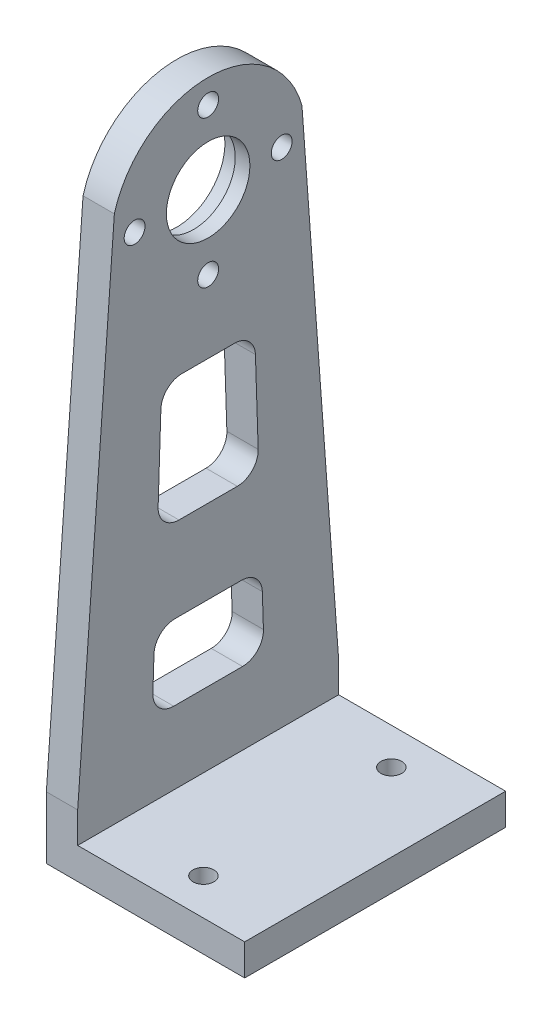
ISO-10303-21;
HEADER;
FILE_DESCRIPTION(('STEP AP214'),'2;1');
FILE_NAME('part.step','',(''),(''),'','','');
FILE_SCHEMA(('AUTOMOTIVE_DESIGN { 1 0 10303 214 1 1 1 1 }'));
ENDSEC;
DATA;
#1=APPLICATION_CONTEXT('core data for automotive mechanical design processes');
#2=APPLICATION_PROTOCOL_DEFINITION('international standard','automotive_design',2000,#1);
#3=PRODUCT_CONTEXT('',#1,'mechanical');
#4=PRODUCT('Part','Part','',(#3));
#5=PRODUCT_RELATED_PRODUCT_CATEGORY('part','',(#4));
#6=PRODUCT_DEFINITION_FORMATION('','',#4);
#7=PRODUCT_DEFINITION_CONTEXT('part definition',#1,'design');
#8=PRODUCT_DEFINITION('design','',#6,#7);
#9=PRODUCT_DEFINITION_SHAPE('','',#8);
#10=(LENGTH_UNIT() NAMED_UNIT(*) SI_UNIT(.MILLI.,.METRE.));
#11=(NAMED_UNIT(*) PLANE_ANGLE_UNIT() SI_UNIT($,.RADIAN.));
#12=(NAMED_UNIT(*) SI_UNIT($,.STERADIAN.) SOLID_ANGLE_UNIT());
#13=UNCERTAINTY_MEASURE_WITH_UNIT(LENGTH_MEASURE(1.E-05),#10,'distance_accuracy_value','');
#14=(GEOMETRIC_REPRESENTATION_CONTEXT(3) GLOBAL_UNCERTAINTY_ASSIGNED_CONTEXT((#13)) GLOBAL_UNIT_ASSIGNED_CONTEXT((#10,
#11,#12)) REPRESENTATION_CONTEXT('',''));
#15=CARTESIAN_POINT('',(0.,0.,0.));
#16=DIRECTION('',(0.,0.,1.));
#17=DIRECTION('',(1.,0.,0.));
#18=AXIS2_PLACEMENT_3D('',#15,#16,#17);
#19=CARTESIAN_POINT('',(15.5,-52.,0.));
#20=DIRECTION('',(-1.,0.,0.));
#21=DIRECTION('',(0.,0.,1.));
#22=AXIS2_PLACEMENT_3D('',#19,#20,#21);
#23=CYLINDRICAL_SURFACE('',#22,4.);
#24=CARTESIAN_POINT('',(16.5,-52.,0.));
#25=DIRECTION('',(-1.,0.,0.));
#26=DIRECTION('',(0.,0.,-1.));
#27=AXIS2_PLACEMENT_3D('',#24,#25,#26);
#28=CIRCLE('',#27,4.);
#29=CARTESIAN_POINT('',(16.5,-52.,-4.));
#30=VERTEX_POINT('',#29);
#31=EDGE_CURVE('E48',#30,#30,#28,.T.);
#32=ORIENTED_EDGE('',*,*,#31,.F.);
#33=EDGE_LOOP('',(#32));
#34=FACE_BOUND('',#33,.T.);
#35=CARTESIAN_POINT('',(15.1,-52.,0.));
#36=DIRECTION('',(-1.,0.,0.));
#37=DIRECTION('',(0.,0.,1.));
#38=AXIS2_PLACEMENT_3D('',#35,#36,#37);
#39=CIRCLE('',#38,4.);
#40=CARTESIAN_POINT('',(15.1,-52.,4.));
#41=VERTEX_POINT('',#40);
#42=EDGE_CURVE('E42',#41,#41,#39,.F.);
#43=ORIENTED_EDGE('',*,*,#42,.F.);
#44=EDGE_LOOP('',(#43));
#45=FACE_BOUND('',#44,.T.);
#46=ADVANCED_FACE('F39',(#34,#45),#23,.F.);
#47=CARTESIAN_POINT('',(16.5,-100.7,-12.5));
#48=DIRECTION('',(1.,0.,0.));
#49=DIRECTION('',(0.,-1.,0.));
#50=AXIS2_PLACEMENT_3D('',#47,#48,#49);
#51=PLANE('',#50);
#52=CARTESIAN_POINT('',(16.5,-59.0452123011725,1.54223501579341E-13));
#53=DIRECTION('',(-1.,0.,0.));
#54=DIRECTION('',(0.,0.,1.));
#55=AXIS2_PLACEMENT_3D('',#52,#53,#54);
#56=CIRCLE('',#55,1.);
#57=CARTESIAN_POINT('',(16.5,-59.0452123011725,1.00000000000015));
#58=VERTEX_POINT('',#57);
#59=EDGE_CURVE('E521',#58,#58,#56,.T.);
#60=ORIENTED_EDGE('',*,*,#59,.T.);
#61=EDGE_LOOP('',(#60));
#62=FACE_BOUND('',#61,.T.);
#63=CARTESIAN_POINT('',(16.5,-52.,7.04521230117253));
#64=DIRECTION('',(-1.,0.,0.));
#65=DIRECTION('',(0.,0.,1.));
#66=AXIS2_PLACEMENT_3D('',#63,#64,#65);
#67=CIRCLE('',#66,1.00000000000001);
#68=CARTESIAN_POINT('',(16.5,-52.,8.04521230117253));
#69=VERTEX_POINT('',#68);
#70=EDGE_CURVE('E527',#69,#69,#67,.T.);
#71=ORIENTED_EDGE('',*,*,#70,.T.);
#72=EDGE_LOOP('',(#71));
#73=FACE_BOUND('',#72,.T.);
#74=CARTESIAN_POINT('',(16.5,-52.0000000000001,-7.04521230117231));
#75=DIRECTION('',(-1.,0.,0.));
#76=DIRECTION('',(0.,0.,1.));
#77=AXIS2_PLACEMENT_3D('',#74,#75,#76);
#78=CIRCLE('',#77,1.);
#79=CARTESIAN_POINT('',(16.5,-52.0000000000001,-6.04521230117231));
#80=VERTEX_POINT('',#79);
#81=EDGE_CURVE('E533',#80,#80,#78,.T.);
#82=ORIENTED_EDGE('',*,*,#81,.T.);
#83=EDGE_LOOP('',(#82));
#84=FACE_BOUND('',#83,.T.);
#85=CARTESIAN_POINT('',(16.5,-44.9547876988277,0.));
#86=DIRECTION('',(-1.,0.,0.));
#87=DIRECTION('',(0.,0.,1.));
#88=AXIS2_PLACEMENT_3D('',#85,#86,#87);
#89=CIRCLE('',#88,1.);
#90=CARTESIAN_POINT('',(16.5,-44.9547876988277,1.00000000000001));
#91=VERTEX_POINT('',#90);
#92=EDGE_CURVE('E198',#91,#91,#89,.T.);
#93=ORIENTED_EDGE('',*,*,#92,.T.);
#94=EDGE_LOOP('',(#93));
#95=FACE_BOUND('',#94,.T.);
#96=DIRECTION('',(0.,-0.997297605701587,-0.0734675823876265));
#97=VECTOR('',#96,1.);
#98=CARTESIAN_POINT('',(16.5,-100.681108800183,-12.7564416540415));
#99=LINE('',#98,#97);
#100=CARTESIAN_POINT('',(16.5,-49.5,-8.986100377806));
#101=VERTEX_POINT('',#100);
#102=CARTESIAN_POINT('',(16.5,-97.2,-12.5));
#103=VERTEX_POINT('',#102);
#104=EDGE_CURVE('E173',#101,#103,#99,.T.);
#105=ORIENTED_EDGE('',*,*,#104,.F.);
#106=CARTESIAN_POINT('',(16.5,-52.0000000000001,0.));
#107=DIRECTION('',(1.,0.,0.));
#108=DIRECTION('',(0.,0.,-1.));
#109=AXIS2_PLACEMENT_3D('',#106,#107,#108);
#110=CIRCLE('',#109,9.32737905308911);
#111=CARTESIAN_POINT('',(16.5,-49.5,8.986100377806));
#112=VERTEX_POINT('',#111);
#113=EDGE_CURVE('E188',#101,#112,#110,.T.);
#114=ORIENTED_EDGE('',*,*,#113,.T.);
#115=DIRECTION('',(0.,0.997297605701587,-0.0734675823876265));
#116=VECTOR('',#115,1.);
#117=CARTESIAN_POINT('',(16.5,-98.8493826998868,12.6215045124945));
#118=LINE('',#117,#116);
#119=CARTESIAN_POINT('',(16.5,-97.2,12.5));
#120=VERTEX_POINT('',#119);
#121=EDGE_CURVE('E193',#120,#112,#118,.T.);
#122=ORIENTED_EDGE('',*,*,#121,.F.);
#123=DIRECTION('',(0.,1.,0.));
#124=VECTOR('',#123,1.);
#125=CARTESIAN_POINT('',(16.5,-100.7,12.5));
#126=LINE('',#125,#124);
#127=CARTESIAN_POINT('',(16.5,-100.149489742783,12.5));
#128=VERTEX_POINT('',#127);
#129=EDGE_CURVE('E153',#128,#120,#126,.T.);
#130=ORIENTED_EDGE('',*,*,#129,.F.);
#131=DIRECTION('',(0.,0.,1.));
#132=VECTOR('',#131,1.);
#133=CARTESIAN_POINT('',(16.5,-100.149489742783,12.5));
#134=LINE('',#133,#132);
#135=CARTESIAN_POINT('',(16.5,-100.149489742783,-12.5));
#136=VERTEX_POINT('',#135);
#137=EDGE_CURVE('E192',#136,#128,#134,.T.);
#138=ORIENTED_EDGE('',*,*,#137,.F.);
#139=DIRECTION('',(0.,1.,0.));
#140=VECTOR('',#139,1.);
#141=CARTESIAN_POINT('',(16.5,-100.7,-12.5));
#142=LINE('',#141,#140);
#143=EDGE_CURVE('E11',#136,#103,#142,.T.);
#144=ORIENTED_EDGE('',*,*,#143,.T.);
#145=EDGE_LOOP('',(#105,#114,#122,#130,#138,#144));
#146=FACE_BOUND('',#145,.T.);
#147=ORIENTED_EDGE('',*,*,#31,.T.);
#148=EDGE_LOOP('',(#147));
#149=FACE_BOUND('',#148,.T.);
#150=CARTESIAN_POINT('',(16.5,-91.2,-3.296767463509));
#151=DIRECTION('',(-1.,0.,0.));
#152=DIRECTION('',(0.,0.0330349000935773,-0.999454198738395));
#153=AXIS2_PLACEMENT_3D('',#150,#151,#152);
#154=CIRCLE('',#153,2.);
#155=CARTESIAN_POINT('',(16.5,-91.13393019981,-5.295675860986));
#156=VERTEX_POINT('',#155);
#157=CARTESIAN_POINT('',(16.5,-93.2,-3.296767463509));
#158=VERTEX_POINT('',#157);
#159=EDGE_CURVE('E260',#156,#158,#154,.T.);
#160=ORIENTED_EDGE('',*,*,#159,.T.);
#161=DIRECTION('',(0.,0.,-1.));
#162=VECTOR('',#161,1.);
#163=CARTESIAN_POINT('',(16.5,-93.2,3.296767463509));
#164=LINE('',#163,#162);
#165=CARTESIAN_POINT('',(16.5,-93.2,3.296767463509));
#166=VERTEX_POINT('',#165);
#167=EDGE_CURVE('E135',#166,#158,#164,.T.);
#168=ORIENTED_EDGE('',*,*,#167,.F.);
#169=CARTESIAN_POINT('',(16.5,-91.2,3.296767463509));
#170=DIRECTION('',(-1.,0.,0.));
#171=DIRECTION('',(0.,-1.,0.));
#172=AXIS2_PLACEMENT_3D('',#169,#170,#171);
#173=CIRCLE('',#172,2.);
#174=CARTESIAN_POINT('',(16.5,-91.13393019981,5.295675860986));
#175=VERTEX_POINT('',#174);
#176=EDGE_CURVE('E266',#166,#175,#173,.T.);
#177=ORIENTED_EDGE('',*,*,#176,.T.);
#178=DIRECTION('',(0.,-0.999454198738395,0.0330349000935798));
#179=VECTOR('',#178,1.);
#180=CARTESIAN_POINT('',(16.5,-87.93393019981,5.189906451609));
#181=LINE('',#180,#179);
#182=CARTESIAN_POINT('',(16.5,-87.93393019981,5.189906451609));
#183=VERTEX_POINT('',#182);
#184=EDGE_CURVE('E146',#183,#175,#181,.T.);
#185=ORIENTED_EDGE('',*,*,#184,.F.);
#186=CARTESIAN_POINT('',(16.5,-88.,3.190998054133));
#187=DIRECTION('',(-1.,0.,0.));
#188=DIRECTION('',(0.,0.0330349000935773,0.999454198738395));
#189=AXIS2_PLACEMENT_3D('',#186,#187,#188);
#190=CIRCLE('',#189,2.);
#191=CARTESIAN_POINT('',(16.5,-86.,3.190998054133));
#192=VERTEX_POINT('',#191);
#193=EDGE_CURVE('E127',#183,#192,#190,.T.);
#194=ORIENTED_EDGE('',*,*,#193,.T.);
#195=DIRECTION('',(0.,0.,1.));
#196=VECTOR('',#195,1.);
#197=CARTESIAN_POINT('',(16.5,-86.,-3.190998054133));
#198=LINE('',#197,#196);
#199=CARTESIAN_POINT('',(16.5,-86.,-3.190998054133));
#200=VERTEX_POINT('',#199);
#201=EDGE_CURVE('E102',#200,#192,#198,.T.);
#202=ORIENTED_EDGE('',*,*,#201,.F.);
#203=CARTESIAN_POINT('',(16.5,-88.,-3.190998054133));
#204=DIRECTION('',(-1.,0.,0.));
#205=DIRECTION('',(0.,1.,0.));
#206=AXIS2_PLACEMENT_3D('',#203,#204,#205);
#207=CIRCLE('',#206,2.);
#208=CARTESIAN_POINT('',(16.5,-87.93393019981,-5.189906451609));
#209=VERTEX_POINT('',#208);
#210=EDGE_CURVE('E121',#200,#209,#207,.T.);
#211=ORIENTED_EDGE('',*,*,#210,.T.);
#212=DIRECTION('',(0.,0.999454198738395,0.0330349000935798));
#213=VECTOR('',#212,1.);
#214=CARTESIAN_POINT('',(16.5,-91.13393019981,-5.295675860986));
#215=LINE('',#214,#213);
#216=EDGE_CURVE('E108',#156,#209,#215,.T.);
#217=ORIENTED_EDGE('',*,*,#216,.F.);
#218=EDGE_LOOP('',(#160,#168,#177,#185,#194,#202,#211,#217));
#219=FACE_BOUND('',#218,.T.);
#220=CARTESIAN_POINT('',(16.5,-68.,-2.529939245529));
#221=DIRECTION('',(-1.,0.,0.));
#222=DIRECTION('',(0.,1.,0.));
#223=AXIS2_PLACEMENT_3D('',#220,#221,#222);
#224=CIRCLE('',#223,2.);
#225=CARTESIAN_POINT('',(16.5,-66.,-2.529939245529));
#226=VERTEX_POINT('',#225);
#227=CARTESIAN_POINT('',(16.5,-67.93393019981,-4.528847643006));
#228=VERTEX_POINT('',#227);
#229=EDGE_CURVE('E240',#226,#228,#224,.T.);
#230=ORIENTED_EDGE('',*,*,#229,.T.);
#231=DIRECTION('',(0.,0.999454198738395,0.0330349000935798));
#232=VECTOR('',#231,1.);
#233=CARTESIAN_POINT('',(16.5,-75.93393019981,-4.793271166447));
#234=LINE('',#233,#232);
#235=CARTESIAN_POINT('',(16.5,-75.93393019981,-4.793271166447));
#236=VERTEX_POINT('',#235);
#237=EDGE_CURVE('E57',#236,#228,#234,.T.);
#238=ORIENTED_EDGE('',*,*,#237,.F.);
#239=CARTESIAN_POINT('',(16.5,-76.,-2.794362768971));
#240=DIRECTION('',(-1.,0.,0.));
#241=DIRECTION('',(0.,0.0330349000935773,-0.999454198738395));
#242=AXIS2_PLACEMENT_3D('',#239,#240,#241);
#243=CIRCLE('',#242,2.);
#244=CARTESIAN_POINT('',(16.5,-78.,-2.794362768971));
#245=VERTEX_POINT('',#244);
#246=EDGE_CURVE('E242',#236,#245,#243,.T.);
#247=ORIENTED_EDGE('',*,*,#246,.T.);
#248=DIRECTION('',(0.,0.,-1.));
#249=VECTOR('',#248,1.);
#250=CARTESIAN_POINT('',(16.5,-78.,2.794362768971));
#251=LINE('',#250,#249);
#252=CARTESIAN_POINT('',(16.5,-78.,2.794362768971));
#253=VERTEX_POINT('',#252);
#254=EDGE_CURVE('E249',#253,#245,#251,.T.);
#255=ORIENTED_EDGE('',*,*,#254,.F.);
#256=CARTESIAN_POINT('',(16.5,-76.,2.794362768971));
#257=DIRECTION('',(-1.,0.,0.));
#258=DIRECTION('',(0.,-1.,0.));
#259=AXIS2_PLACEMENT_3D('',#256,#257,#258);
#260=CIRCLE('',#259,2.);
#261=CARTESIAN_POINT('',(16.5,-75.93393019981,4.793271166447));
#262=VERTEX_POINT('',#261);
#263=EDGE_CURVE('E248',#253,#262,#260,.T.);
#264=ORIENTED_EDGE('',*,*,#263,.T.);
#265=DIRECTION('',(0.,-0.999454198738395,0.0330349000935798));
#266=VECTOR('',#265,1.);
#267=CARTESIAN_POINT('',(16.5,-67.93393019981,4.528847643006));
#268=LINE('',#267,#266);
#269=CARTESIAN_POINT('',(16.5,-67.93393019981,4.528847643006));
#270=VERTEX_POINT('',#269);
#271=EDGE_CURVE('E128',#270,#262,#268,.T.);
#272=ORIENTED_EDGE('',*,*,#271,.F.);
#273=CARTESIAN_POINT('',(16.5,-68.,2.529939245529));
#274=DIRECTION('',(-1.,0.,0.));
#275=DIRECTION('',(0.,0.0330349000935773,0.999454198738395));
#276=AXIS2_PLACEMENT_3D('',#273,#274,#275);
#277=CIRCLE('',#276,2.);
#278=CARTESIAN_POINT('',(16.5,-66.,2.529939245529));
#279=VERTEX_POINT('',#278);
#280=EDGE_CURVE('E255',#270,#279,#277,.T.);
#281=ORIENTED_EDGE('',*,*,#280,.T.);
#282=DIRECTION('',(0.,0.,1.));
#283=VECTOR('',#282,1.);
#284=CARTESIAN_POINT('',(16.5,-66.,-2.529939245529));
#285=LINE('',#284,#283);
#286=EDGE_CURVE('E261',#226,#279,#285,.T.);
#287=ORIENTED_EDGE('',*,*,#286,.F.);
#288=EDGE_LOOP('',(#230,#238,#247,#255,#264,#272,#281,#287));
#289=FACE_BOUND('',#288,.T.);
#290=ADVANCED_FACE('F122',(#62,#73,#84,#95,#146,#149,#219,#289),#51,.T.);
#291=CARTESIAN_POINT('',(15.5,-70.85,12.5));
#292=DIRECTION('',(0.,0.,-1.));
#293=DIRECTION('',(0.,-1.,0.));
#294=AXIS2_PLACEMENT_3D('',#291,#292,#293);
#295=PLANE('',#294);
#296=DIRECTION('',(-1.,0.,0.));
#297=VECTOR('',#296,1.);
#298=CARTESIAN_POINT('',(32.5,-100.149489742783,12.5));
#299=LINE('',#298,#297);
#300=CARTESIAN_POINT('',(32.5,-100.149489742783,12.5));
#301=VERTEX_POINT('',#300);
#302=EDGE_CURVE('E223',#301,#128,#299,.T.);
#303=ORIENTED_EDGE('',*,*,#302,.T.);
#304=ORIENTED_EDGE('',*,*,#129,.T.);
#305=DIRECTION('',(-1.,0.,0.));
#306=VECTOR('',#305,1.);
#307=CARTESIAN_POINT('',(16.5,-97.2,12.5));
#308=LINE('',#307,#306);
#309=CARTESIAN_POINT('',(13.5,-97.2,12.5));
#310=VERTEX_POINT('',#309);
#311=EDGE_CURVE('E159',#120,#310,#308,.T.);
#312=ORIENTED_EDGE('',*,*,#311,.T.);
#313=DIRECTION('',(0.,-1.,0.));
#314=VECTOR('',#313,1.);
#315=CARTESIAN_POINT('',(13.5,0.,12.5));
#316=LINE('',#315,#314);
#317=CARTESIAN_POINT('',(13.5,-103.149489742783,12.5));
#318=VERTEX_POINT('',#317);
#319=EDGE_CURVE('E385',#310,#318,#316,.T.);
#320=ORIENTED_EDGE('',*,*,#319,.T.);
#321=DIRECTION('',(-1.,0.,0.));
#322=VECTOR('',#321,1.);
#323=CARTESIAN_POINT('',(75.6884089130718,-103.149489742783,12.5));
#324=LINE('',#323,#322);
#325=CARTESIAN_POINT('',(32.5,-103.149489742783,12.5));
#326=VERTEX_POINT('',#325);
#327=EDGE_CURVE('E231',#326,#318,#324,.T.);
#328=ORIENTED_EDGE('',*,*,#327,.F.);
#329=DIRECTION('',(0.,-1.,0.));
#330=VECTOR('',#329,1.);
#331=CARTESIAN_POINT('',(32.5,-103.149489742783,12.5));
#332=LINE('',#331,#330);
#333=EDGE_CURVE('E211',#301,#326,#332,.T.);
#334=ORIENTED_EDGE('',*,*,#333,.F.);
#335=EDGE_LOOP('',(#303,#304,#312,#320,#328,#334));
#336=FACE_BOUND('',#335,.T.);
#337=ADVANCED_FACE('F376',(#336),#295,.F.);
#338=CARTESIAN_POINT('',(15.93933982822,-101.76066017178,-12.5));
#339=DIRECTION('',(0.,0.,-1.));
#340=DIRECTION('',(1.,0.,0.));
#341=AXIS2_PLACEMENT_3D('',#338,#339,#340);
#342=PLANE('',#341);
#343=DIRECTION('',(-1.,0.,0.));
#344=VECTOR('',#343,1.);
#345=CARTESIAN_POINT('',(75.6884089130718,-103.149489742783,-12.5));
#346=LINE('',#345,#344);
#347=CARTESIAN_POINT('',(32.5,-103.149489742783,-12.5));
#348=VERTEX_POINT('',#347);
#349=CARTESIAN_POINT('',(13.5,-103.149489742783,-12.5));
#350=VERTEX_POINT('',#349);
#351=EDGE_CURVE('E158',#348,#350,#346,.T.);
#352=ORIENTED_EDGE('',*,*,#351,.T.);
#353=DIRECTION('',(0.,1.,0.));
#354=VECTOR('',#353,1.);
#355=CARTESIAN_POINT('',(13.5,0.,-12.5));
#356=LINE('',#355,#354);
#357=CARTESIAN_POINT('',(13.5,-97.2,-12.5));
#358=VERTEX_POINT('',#357);
#359=EDGE_CURVE('E393',#350,#358,#356,.T.);
#360=ORIENTED_EDGE('',*,*,#359,.T.);
#361=DIRECTION('',(-1.,0.,0.));
#362=VECTOR('',#361,1.);
#363=CARTESIAN_POINT('',(16.5,-97.2,-12.5));
#364=LINE('',#363,#362);
#365=EDGE_CURVE('E162',#103,#358,#364,.T.);
#366=ORIENTED_EDGE('',*,*,#365,.F.);
#367=ORIENTED_EDGE('',*,*,#143,.F.);
#368=DIRECTION('',(-1.,0.,0.));
#369=VECTOR('',#368,1.);
#370=CARTESIAN_POINT('',(32.5,-100.149489742783,-12.5));
#371=LINE('',#370,#369);
#372=CARTESIAN_POINT('',(32.5,-100.149489742783,-12.5));
#373=VERTEX_POINT('',#372);
#374=EDGE_CURVE('E228',#373,#136,#371,.T.);
#375=ORIENTED_EDGE('',*,*,#374,.F.);
#376=DIRECTION('',(0.,1.,0.));
#377=VECTOR('',#376,1.);
#378=CARTESIAN_POINT('',(32.5,-100.149489742783,-12.5));
#379=LINE('',#378,#377);
#380=EDGE_CURVE('E217',#348,#373,#379,.T.);
#381=ORIENTED_EDGE('',*,*,#380,.F.);
#382=EDGE_LOOP('',(#352,#360,#366,#367,#375,#381));
#383=FACE_BOUND('',#382,.T.);
#384=ADVANCED_FACE('F478',(#383),#342,.T.);
#385=CARTESIAN_POINT('',(15.5,-72.,4.663243205897));
#386=DIRECTION('',(0.,0.0330349000935798,0.999454198738395));
#387=DIRECTION('',(0.,0.999454198738395,-0.0330349000935798));
#388=AXIS2_PLACEMENT_3D('',#385,#386,#387);
#389=PLANE('',#388);
#390=ORIENTED_EDGE('',*,*,#271,.T.);
#391=DIRECTION('',(-1.,0.,0.));
#392=VECTOR('',#391,1.);
#393=CARTESIAN_POINT('',(16.5,-75.93393019981,4.793271166447));
#394=LINE('',#393,#392);
#395=CARTESIAN_POINT('',(13.5,-75.93393019981,4.79327116644733));
#396=VERTEX_POINT('',#395);
#397=EDGE_CURVE('E257',#262,#396,#394,.T.);
#398=ORIENTED_EDGE('',*,*,#397,.T.);
#399=DIRECTION('',(0.,0.999454198738395,-0.0330349000935798));
#400=VECTOR('',#399,1.);
#401=CARTESIAN_POINT('',(13.5,0.0753917599162948,2.28093957557516));
#402=LINE('',#401,#400);
#403=CARTESIAN_POINT('',(13.5,-67.93393019981,4.5288476430057));
#404=VERTEX_POINT('',#403);
#405=EDGE_CURVE('E328',#396,#404,#402,.T.);
#406=ORIENTED_EDGE('',*,*,#405,.T.);
#407=DIRECTION('',(-1.,0.,0.));
#408=VECTOR('',#407,1.);
#409=CARTESIAN_POINT('',(16.5,-67.93393019981,4.528847643006));
#410=LINE('',#409,#408);
#411=EDGE_CURVE('E263',#270,#404,#410,.T.);
#412=ORIENTED_EDGE('',*,*,#411,.F.);
#413=EDGE_LOOP('',(#390,#398,#406,#412));
#414=FACE_BOUND('',#413,.T.);
#415=ADVANCED_FACE('F476',(#414),#389,.F.);
#416=CARTESIAN_POINT('',(118.162,-68.,2.529939245529));
#417=DIRECTION('',(-1.,0.,0.));
#418=DIRECTION('',(0.,-0.0330349000935773,-0.999454198738395));
#419=AXIS2_PLACEMENT_3D('',#416,#417,#418);
#420=CYLINDRICAL_SURFACE('',#419,2.);
#421=ORIENTED_EDGE('',*,*,#411,.T.);
#422=CARTESIAN_POINT('',(13.5,-68.,2.529939245529));
#423=DIRECTION('',(1.,0.,0.));
#424=DIRECTION('',(0.,0.,-1.));
#425=AXIS2_PLACEMENT_3D('',#422,#423,#424);
#426=CIRCLE('',#425,2.);
#427=CARTESIAN_POINT('',(13.5,-66.,2.529939245529));
#428=VERTEX_POINT('',#427);
#429=EDGE_CURVE('E207',#404,#428,#426,.F.);
#430=ORIENTED_EDGE('',*,*,#429,.T.);
#431=DIRECTION('',(-1.,0.,0.));
#432=VECTOR('',#431,1.);
#433=CARTESIAN_POINT('',(16.5,-66.,2.529939245529));
#434=LINE('',#433,#432);
#435=EDGE_CURVE('E264',#279,#428,#434,.T.);
#436=ORIENTED_EDGE('',*,*,#435,.F.);
#437=ORIENTED_EDGE('',*,*,#280,.F.);
#438=EDGE_LOOP('',(#421,#430,#436,#437));
#439=FACE_BOUND('',#438,.T.);
#440=ADVANCED_FACE('F339',(#439),#420,.F.);
#441=CARTESIAN_POINT('',(15.5,-66.,0.));
#442=DIRECTION('',(0.,1.,0.));
#443=DIRECTION('',(0.,0.,-1.));
#444=AXIS2_PLACEMENT_3D('',#441,#442,#443);
#445=PLANE('',#444);
#446=ORIENTED_EDGE('',*,*,#286,.T.);
#447=ORIENTED_EDGE('',*,*,#435,.T.);
#448=DIRECTION('',(0.,0.,-1.));
#449=VECTOR('',#448,1.);
#450=CARTESIAN_POINT('',(13.5,-66.,0.));
#451=LINE('',#450,#449);
#452=CARTESIAN_POINT('',(13.5,-66.,-2.529939245529));
#453=VERTEX_POINT('',#452);
#454=EDGE_CURVE('E308',#428,#453,#451,.T.);
#455=ORIENTED_EDGE('',*,*,#454,.T.);
#456=DIRECTION('',(-1.,0.,0.));
#457=VECTOR('',#456,1.);
#458=CARTESIAN_POINT('',(16.5,-66.,-2.529939245529));
#459=LINE('',#458,#457);
#460=EDGE_CURVE('E244',#226,#453,#459,.T.);
#461=ORIENTED_EDGE('',*,*,#460,.F.);
#462=EDGE_LOOP('',(#446,#447,#455,#461));
#463=FACE_BOUND('',#462,.T.);
#464=ADVANCED_FACE('F474',(#463),#445,.F.);
#465=CARTESIAN_POINT('',(118.162,-68.,-2.529939245529));
#466=DIRECTION('',(-1.,0.,0.));
#467=DIRECTION('',(0.,-1.,0.));
#468=AXIS2_PLACEMENT_3D('',#465,#466,#467);
#469=CYLINDRICAL_SURFACE('',#468,2.);
#470=ORIENTED_EDGE('',*,*,#460,.T.);
#471=CARTESIAN_POINT('',(13.5,-68.,-2.529939245529));
#472=DIRECTION('',(1.,0.,0.));
#473=DIRECTION('',(0.,0.,-1.));
#474=AXIS2_PLACEMENT_3D('',#471,#472,#473);
#475=CIRCLE('',#474,2.);
#476=CARTESIAN_POINT('',(13.5,-67.93393019981,-4.52884764300567));
#477=VERTEX_POINT('',#476);
#478=EDGE_CURVE('E311',#453,#477,#475,.F.);
#479=ORIENTED_EDGE('',*,*,#478,.T.);
#480=DIRECTION('',(-1.,0.,0.));
#481=VECTOR('',#480,1.);
#482=CARTESIAN_POINT('',(16.5,-67.93393019981,-4.528847643006));
#483=LINE('',#482,#481);
#484=EDGE_CURVE('E245',#228,#477,#483,.T.);
#485=ORIENTED_EDGE('',*,*,#484,.F.);
#486=ORIENTED_EDGE('',*,*,#229,.F.);
#487=EDGE_LOOP('',(#470,#479,#485,#486));
#488=FACE_BOUND('',#487,.T.);
#489=ADVANCED_FACE('F471',(#488),#469,.F.);
#490=CARTESIAN_POINT('',(15.5,-72.,-4.663243205897));
#491=DIRECTION('',(0.,0.0330349000935798,-0.999454198738395));
#492=DIRECTION('',(0.,-0.999454198738395,-0.0330349000935798));
#493=AXIS2_PLACEMENT_3D('',#490,#491,#492);
#494=PLANE('',#493);
#495=ORIENTED_EDGE('',*,*,#484,.T.);
#496=DIRECTION('',(0.,-0.999454198738395,-0.0330349000935798));
#497=VECTOR('',#496,1.);
#498=CARTESIAN_POINT('',(13.5,0.0753917599162838,-2.28093957557483));
#499=LINE('',#498,#497);
#500=CARTESIAN_POINT('',(13.5,-75.9339301998128,-4.79327116644779));
#501=VERTEX_POINT('',#500);
#502=EDGE_CURVE('E317',#477,#501,#499,.T.);
#503=ORIENTED_EDGE('',*,*,#502,.T.);
#504=DIRECTION('',(-1.,0.,0.));
#505=VECTOR('',#504,1.);
#506=CARTESIAN_POINT('',(16.5,-75.93393019981,-4.793271166447));
#507=LINE('',#506,#505);
#508=EDGE_CURVE('E251',#236,#501,#507,.T.);
#509=ORIENTED_EDGE('',*,*,#508,.F.);
#510=ORIENTED_EDGE('',*,*,#237,.T.);
#511=EDGE_LOOP('',(#495,#503,#509,#510));
#512=FACE_BOUND('',#511,.T.);
#513=ADVANCED_FACE('F467',(#512),#494,.F.);
#514=CARTESIAN_POINT('',(118.162,-76.,-2.794362768971));
#515=DIRECTION('',(-1.,0.,0.));
#516=DIRECTION('',(0.,-0.0330349000935773,0.999454198738395));
#517=AXIS2_PLACEMENT_3D('',#514,#515,#516);
#518=CYLINDRICAL_SURFACE('',#517,2.);
#519=ORIENTED_EDGE('',*,*,#508,.T.);
#520=CARTESIAN_POINT('',(13.5,-76.,-2.794362768971));
#521=DIRECTION('',(1.,0.,0.));
#522=DIRECTION('',(0.,0.,-1.));
#523=AXIS2_PLACEMENT_3D('',#520,#521,#522);
#524=CIRCLE('',#523,2.);
#525=CARTESIAN_POINT('',(13.5,-78.,-2.794362768971));
#526=VERTEX_POINT('',#525);
#527=EDGE_CURVE('E320',#501,#526,#524,.F.);
#528=ORIENTED_EDGE('',*,*,#527,.T.);
#529=DIRECTION('',(-1.,0.,0.));
#530=VECTOR('',#529,1.);
#531=CARTESIAN_POINT('',(16.5,-78.,-2.794362768971));
#532=LINE('',#531,#530);
#533=EDGE_CURVE('E252',#245,#526,#532,.T.);
#534=ORIENTED_EDGE('',*,*,#533,.F.);
#535=ORIENTED_EDGE('',*,*,#246,.F.);
#536=EDGE_LOOP('',(#519,#528,#534,#535));
#537=FACE_BOUND('',#536,.T.);
#538=ADVANCED_FACE('F465',(#537),#518,.F.);
#539=CARTESIAN_POINT('',(15.5,-78.,0.));
#540=DIRECTION('',(0.,-1.,0.));
#541=DIRECTION('',(0.,0.,1.));
#542=AXIS2_PLACEMENT_3D('',#539,#540,#541);
#543=PLANE('',#542);
#544=ORIENTED_EDGE('',*,*,#254,.T.);
#545=ORIENTED_EDGE('',*,*,#533,.T.);
#546=DIRECTION('',(0.,0.,1.));
#547=VECTOR('',#546,1.);
#548=CARTESIAN_POINT('',(13.5,-78.,0.));
#549=LINE('',#548,#547);
#550=CARTESIAN_POINT('',(13.5,-78.,2.794362768971));
#551=VERTEX_POINT('',#550);
#552=EDGE_CURVE('E323',#526,#551,#549,.T.);
#553=ORIENTED_EDGE('',*,*,#552,.T.);
#554=DIRECTION('',(-1.,0.,0.));
#555=VECTOR('',#554,1.);
#556=CARTESIAN_POINT('',(16.5,-78.,2.794362768971));
#557=LINE('',#556,#555);
#558=EDGE_CURVE('E272',#253,#551,#557,.T.);
#559=ORIENTED_EDGE('',*,*,#558,.F.);
#560=EDGE_LOOP('',(#544,#545,#553,#559));
#561=FACE_BOUND('',#560,.T.);
#562=ADVANCED_FACE('F461',(#561),#543,.F.);
#563=CARTESIAN_POINT('',(118.162,-76.,2.794362768971));
#564=DIRECTION('',(-1.,0.,0.));
#565=DIRECTION('',(0.,1.,0.));
#566=AXIS2_PLACEMENT_3D('',#563,#564,#565);
#567=CYLINDRICAL_SURFACE('',#566,2.);
#568=ORIENTED_EDGE('',*,*,#558,.T.);
#569=CARTESIAN_POINT('',(13.5,-76.,2.794362768971));
#570=DIRECTION('',(1.,0.,0.));
#571=DIRECTION('',(0.,0.,-1.));
#572=AXIS2_PLACEMENT_3D('',#569,#570,#571);
#573=CIRCLE('',#572,2.);
#574=EDGE_CURVE('E326',#551,#396,#573,.F.);
#575=ORIENTED_EDGE('',*,*,#574,.T.);
#576=ORIENTED_EDGE('',*,*,#397,.F.);
#577=ORIENTED_EDGE('',*,*,#263,.F.);
#578=EDGE_LOOP('',(#568,#575,#576,#577));
#579=FACE_BOUND('',#578,.T.);
#580=ADVANCED_FACE('F456',(#579),#567,.F.);
#581=CARTESIAN_POINT('',(15.5,-86.,0.));
#582=DIRECTION('',(0.,1.,0.));
#583=DIRECTION('',(0.,0.,-1.));
#584=AXIS2_PLACEMENT_3D('',#581,#582,#583);
#585=PLANE('',#584);
#586=ORIENTED_EDGE('',*,*,#201,.T.);
#587=DIRECTION('',(-1.,0.,0.));
#588=VECTOR('',#587,1.);
#589=CARTESIAN_POINT('',(16.5,-86.,3.190998054133));
#590=LINE('',#589,#588);
#591=CARTESIAN_POINT('',(13.5,-86.,3.190998054133));
#592=VERTEX_POINT('',#591);
#593=EDGE_CURVE('E273',#192,#592,#590,.T.);
#594=ORIENTED_EDGE('',*,*,#593,.T.);
#595=DIRECTION('',(0.,0.,-1.));
#596=VECTOR('',#595,1.);
#597=CARTESIAN_POINT('',(13.5,-86.,0.));
#598=LINE('',#597,#596);
#599=CARTESIAN_POINT('',(13.5,-86.,-3.190998054133));
#600=VERTEX_POINT('',#599);
#601=EDGE_CURVE('E297',#592,#600,#598,.T.);
#602=ORIENTED_EDGE('',*,*,#601,.T.);
#603=DIRECTION('',(-1.,0.,0.));
#604=VECTOR('',#603,1.);
#605=CARTESIAN_POINT('',(16.5,-86.,-3.190998054133));
#606=LINE('',#605,#604);
#607=EDGE_CURVE('E119',#200,#600,#606,.T.);
#608=ORIENTED_EDGE('',*,*,#607,.F.);
#609=EDGE_LOOP('',(#586,#594,#602,#608));
#610=FACE_BOUND('',#609,.T.);
#611=ADVANCED_FACE('F298',(#610),#585,.F.);
#612=CARTESIAN_POINT('',(118.162,-88.,-3.190998054133));
#613=DIRECTION('',(-1.,0.,0.));
#614=DIRECTION('',(0.,-1.,0.));
#615=AXIS2_PLACEMENT_3D('',#612,#613,#614);
#616=CYLINDRICAL_SURFACE('',#615,2.);
#617=ORIENTED_EDGE('',*,*,#607,.T.);
#618=CARTESIAN_POINT('',(13.5,-88.,-3.190998054133));
#619=DIRECTION('',(1.,0.,0.));
#620=DIRECTION('',(0.,0.,-1.));
#621=AXIS2_PLACEMENT_3D('',#618,#619,#620);
#622=CIRCLE('',#621,2.);
#623=CARTESIAN_POINT('',(13.5,-87.93393019981,-5.18990645160947));
#624=VERTEX_POINT('',#623);
#625=EDGE_CURVE('E133',#600,#624,#622,.F.);
#626=ORIENTED_EDGE('',*,*,#625,.T.);
#627=DIRECTION('',(-1.,0.,0.));
#628=VECTOR('',#627,1.);
#629=CARTESIAN_POINT('',(16.5,-87.93393019981,-5.189906451609));
#630=LINE('',#629,#628);
#631=EDGE_CURVE('E113',#209,#624,#630,.T.);
#632=ORIENTED_EDGE('',*,*,#631,.F.);
#633=ORIENTED_EDGE('',*,*,#210,.F.);
#634=EDGE_LOOP('',(#617,#626,#632,#633));
#635=FACE_BOUND('',#634,.T.);
#636=ADVANCED_FACE('F131',(#635),#616,.F.);
#637=CARTESIAN_POINT('',(15.5,-89.6,-5.244974957468));
#638=DIRECTION('',(0.,0.0330349000935798,-0.999454198738395));
#639=DIRECTION('',(0.,-0.999454198738395,-0.0330349000935798));
#640=AXIS2_PLACEMENT_3D('',#637,#638,#639);
#641=PLANE('',#640);
#642=ORIENTED_EDGE('',*,*,#631,.T.);
#643=DIRECTION('',(0.,-0.999454198738395,-0.0330349000935798));
#644=VECTOR('',#643,1.);
#645=CARTESIAN_POINT('',(13.5,0.0753917599162994,-2.2809395755753));
#646=LINE('',#645,#644);
#647=CARTESIAN_POINT('',(13.5,-91.13393019981,-5.295675860986));
#648=VERTEX_POINT('',#647);
#649=EDGE_CURVE('E307',#624,#648,#646,.T.);
#650=ORIENTED_EDGE('',*,*,#649,.T.);
#651=DIRECTION('',(-1.,0.,0.));
#652=VECTOR('',#651,1.);
#653=CARTESIAN_POINT('',(16.5,-91.13393019981,-5.295675860986));
#654=LINE('',#653,#652);
#655=EDGE_CURVE('E116',#156,#648,#654,.T.);
#656=ORIENTED_EDGE('',*,*,#655,.F.);
#657=ORIENTED_EDGE('',*,*,#216,.T.);
#658=EDGE_LOOP('',(#642,#650,#656,#657));
#659=FACE_BOUND('',#658,.T.);
#660=ADVANCED_FACE('F109',(#659),#641,.F.);
#661=CARTESIAN_POINT('',(118.162,-91.2,-3.296767463509));
#662=DIRECTION('',(-1.,0.,0.));
#663=DIRECTION('',(0.,-0.0330349000935773,0.999454198738395));
#664=AXIS2_PLACEMENT_3D('',#661,#662,#663);
#665=CYLINDRICAL_SURFACE('',#664,2.);
#666=ORIENTED_EDGE('',*,*,#655,.T.);
#667=CARTESIAN_POINT('',(13.5,-91.2,-3.296767463509));
#668=DIRECTION('',(1.,0.,0.));
#669=DIRECTION('',(0.,0.,-1.));
#670=AXIS2_PLACEMENT_3D('',#667,#668,#669);
#671=CIRCLE('',#670,2.);
#672=CARTESIAN_POINT('',(13.5,-93.2,-3.296767463509));
#673=VERTEX_POINT('',#672);
#674=EDGE_CURVE('E401',#648,#673,#671,.F.);
#675=ORIENTED_EDGE('',*,*,#674,.T.);
#676=DIRECTION('',(-1.,0.,0.));
#677=VECTOR('',#676,1.);
#678=CARTESIAN_POINT('',(16.5,-93.2,-3.296767463509));
#679=LINE('',#678,#677);
#680=EDGE_CURVE('E140',#158,#673,#679,.T.);
#681=ORIENTED_EDGE('',*,*,#680,.F.);
#682=ORIENTED_EDGE('',*,*,#159,.F.);
#683=EDGE_LOOP('',(#666,#675,#681,#682));
#684=FACE_BOUND('',#683,.T.);
#685=ADVANCED_FACE('F440',(#684),#665,.F.);
#686=CARTESIAN_POINT('',(15.5,-93.2,0.));
#687=DIRECTION('',(0.,-1.,0.));
#688=DIRECTION('',(0.,0.,1.));
#689=AXIS2_PLACEMENT_3D('',#686,#687,#688);
#690=PLANE('',#689);
#691=ORIENTED_EDGE('',*,*,#167,.T.);
#692=ORIENTED_EDGE('',*,*,#680,.T.);
#693=DIRECTION('',(0.,0.,1.));
#694=VECTOR('',#693,1.);
#695=CARTESIAN_POINT('',(13.5,-93.2,0.));
#696=LINE('',#695,#694);
#697=CARTESIAN_POINT('',(13.5,-93.2,3.296767463509));
#698=VERTEX_POINT('',#697);
#699=EDGE_CURVE('E404',#673,#698,#696,.T.);
#700=ORIENTED_EDGE('',*,*,#699,.T.);
#701=DIRECTION('',(-1.,0.,0.));
#702=VECTOR('',#701,1.);
#703=CARTESIAN_POINT('',(16.5,-93.2,3.296767463509));
#704=LINE('',#703,#702);
#705=EDGE_CURVE('E143',#166,#698,#704,.T.);
#706=ORIENTED_EDGE('',*,*,#705,.F.);
#707=EDGE_LOOP('',(#691,#692,#700,#706));
#708=FACE_BOUND('',#707,.T.);
#709=ADVANCED_FACE('F435',(#708),#690,.F.);
#710=CARTESIAN_POINT('',(118.162,-91.2,3.296767463509));
#711=DIRECTION('',(-1.,0.,0.));
#712=DIRECTION('',(0.,1.,0.));
#713=AXIS2_PLACEMENT_3D('',#710,#711,#712);
#714=CYLINDRICAL_SURFACE('',#713,2.);
#715=ORIENTED_EDGE('',*,*,#705,.T.);
#716=CARTESIAN_POINT('',(13.5,-91.2,3.296767463509));
#717=DIRECTION('',(1.,0.,0.));
#718=DIRECTION('',(0.,0.,-1.));
#719=AXIS2_PLACEMENT_3D('',#716,#717,#718);
#720=CIRCLE('',#719,2.);
#721=CARTESIAN_POINT('',(13.5,-91.13393019981,5.29567586098553));
#722=VERTEX_POINT('',#721);
#723=EDGE_CURVE('E407',#698,#722,#720,.F.);
#724=ORIENTED_EDGE('',*,*,#723,.T.);
#725=DIRECTION('',(-1.,0.,0.));
#726=VECTOR('',#725,1.);
#727=CARTESIAN_POINT('',(16.5,-91.13393019981,5.295675860986));
#728=LINE('',#727,#726);
#729=EDGE_CURVE('E147',#175,#722,#728,.T.);
#730=ORIENTED_EDGE('',*,*,#729,.F.);
#731=ORIENTED_EDGE('',*,*,#176,.F.);
#732=EDGE_LOOP('',(#715,#724,#730,#731));
#733=FACE_BOUND('',#732,.T.);
#734=ADVANCED_FACE('F429',(#733),#714,.F.);
#735=CARTESIAN_POINT('',(15.5,-89.6,5.244974957468));
#736=DIRECTION('',(0.,0.0330349000935798,0.999454198738395));
#737=DIRECTION('',(0.,0.999454198738395,-0.0330349000935798));
#738=AXIS2_PLACEMENT_3D('',#735,#736,#737);
#739=PLANE('',#738);
#740=ORIENTED_EDGE('',*,*,#184,.T.);
#741=ORIENTED_EDGE('',*,*,#729,.T.);
#742=DIRECTION('',(0.,0.999454198738395,-0.0330349000935798));
#743=VECTOR('',#742,1.);
#744=CARTESIAN_POINT('',(13.5,0.075391759916284,2.28093957557484));
#745=LINE('',#744,#743);
#746=CARTESIAN_POINT('',(13.5,-87.93393019981,5.1899064516097));
#747=VERTEX_POINT('',#746);
#748=EDGE_CURVE('E410',#722,#747,#745,.T.);
#749=ORIENTED_EDGE('',*,*,#748,.T.);
#750=DIRECTION('',(-1.,0.,0.));
#751=VECTOR('',#750,1.);
#752=CARTESIAN_POINT('',(16.5,-87.93393019981,5.189906451609));
#753=LINE('',#752,#751);
#754=EDGE_CURVE('E150',#183,#747,#753,.T.);
#755=ORIENTED_EDGE('',*,*,#754,.F.);
#756=EDGE_LOOP('',(#740,#741,#749,#755));
#757=FACE_BOUND('',#756,.T.);
#758=ADVANCED_FACE('F423',(#757),#739,.F.);
#759=CARTESIAN_POINT('',(118.162,-88.,3.190998054133));
#760=DIRECTION('',(-1.,0.,0.));
#761=DIRECTION('',(0.,-0.0330349000935773,-0.999454198738395));
#762=AXIS2_PLACEMENT_3D('',#759,#760,#761);
#763=CYLINDRICAL_SURFACE('',#762,2.);
#764=ORIENTED_EDGE('',*,*,#754,.T.);
#765=CARTESIAN_POINT('',(13.5,-88.,3.190998054133));
#766=DIRECTION('',(1.,0.,0.));
#767=DIRECTION('',(0.,0.,-1.));
#768=AXIS2_PLACEMENT_3D('',#765,#766,#767);
#769=CIRCLE('',#768,2.);
#770=EDGE_CURVE('E302',#747,#592,#769,.F.);
#771=ORIENTED_EDGE('',*,*,#770,.T.);
#772=ORIENTED_EDGE('',*,*,#593,.F.);
#773=ORIENTED_EDGE('',*,*,#193,.F.);
#774=EDGE_LOOP('',(#764,#771,#772,#773));
#775=FACE_BOUND('',#774,.T.);
#776=ADVANCED_FACE('F413',(#775),#763,.F.);
#777=CARTESIAN_POINT('',(75.6884089130718,-103.149489742783,-12.5));
#778=DIRECTION('',(0.,-1.,0.));
#779=DIRECTION('',(0.,0.,-1.));
#780=AXIS2_PLACEMENT_3D('',#777,#778,#779);
#781=PLANE('',#780);
#782=CARTESIAN_POINT('',(25.05,-103.149489742783,-8.99999999999987));
#783=DIRECTION('',(0.,-1.,0.));
#784=DIRECTION('',(0.,0.,-1.));
#785=AXIS2_PLACEMENT_3D('',#782,#783,#784);
#786=CIRCLE('',#785,0.999999999999779);
#787=CARTESIAN_POINT('',(25.05,-103.149489742783,-9.99999999999965));
#788=VERTEX_POINT('',#787);
#789=EDGE_CURVE('E501',#788,#788,#786,.T.);
#790=ORIENTED_EDGE('',*,*,#789,.F.);
#791=EDGE_LOOP('',(#790));
#792=FACE_BOUND('',#791,.T.);
#793=CARTESIAN_POINT('',(25.0499999999997,-103.149489742783,9.00000000000025));
#794=DIRECTION('',(0.,-1.,0.));
#795=DIRECTION('',(0.,0.,-1.));
#796=AXIS2_PLACEMENT_3D('',#793,#794,#795);
#797=CIRCLE('',#796,1.00000000000002);
#798=CARTESIAN_POINT('',(25.0499999999997,-103.149489742783,8.00000000000023));
#799=VERTEX_POINT('',#798);
#800=EDGE_CURVE('E516',#799,#799,#797,.T.);
#801=ORIENTED_EDGE('',*,*,#800,.F.);
#802=EDGE_LOOP('',(#801));
#803=FACE_BOUND('',#802,.T.);
#804=ORIENTED_EDGE('',*,*,#351,.F.);
#805=DIRECTION('',(0.,0.,-1.));
#806=VECTOR('',#805,1.);
#807=CARTESIAN_POINT('',(32.5,-103.149489742783,-12.5));
#808=LINE('',#807,#806);
#809=EDGE_CURVE('E214',#326,#348,#808,.T.);
#810=ORIENTED_EDGE('',*,*,#809,.F.);
#811=ORIENTED_EDGE('',*,*,#327,.T.);
#812=DIRECTION('',(0.,0.,-1.));
#813=VECTOR('',#812,1.);
#814=CARTESIAN_POINT('',(13.5,-103.149489742783,-12.5));
#815=LINE('',#814,#813);
#816=EDGE_CURVE('E392',#318,#350,#815,.T.);
#817=ORIENTED_EDGE('',*,*,#816,.T.);
#818=EDGE_LOOP('',(#804,#810,#811,#817));
#819=FACE_BOUND('',#818,.T.);
#820=ADVANCED_FACE('F568',(#792,#803,#819),#781,.T.);
#821=CARTESIAN_POINT('',(32.5,-100.149489742783,12.5));
#822=DIRECTION('',(0.,-1.,0.));
#823=DIRECTION('',(0.,0.,-1.));
#824=AXIS2_PLACEMENT_3D('',#821,#822,#823);
#825=PLANE('',#824);
#826=CARTESIAN_POINT('',(25.05,-100.149489742783,-8.99999999999987));
#827=DIRECTION('',(0.,1.,0.));
#828=DIRECTION('',(0.,0.,1.));
#829=AXIS2_PLACEMENT_3D('',#826,#827,#828);
#830=CIRCLE('',#829,0.999999999999779);
#831=CARTESIAN_POINT('',(25.05,-100.149489742783,-8.0000000000001));
#832=VERTEX_POINT('',#831);
#833=EDGE_CURVE('E498',#832,#832,#830,.T.);
#834=ORIENTED_EDGE('',*,*,#833,.F.);
#835=EDGE_LOOP('',(#834));
#836=FACE_BOUND('',#835,.T.);
#837=CARTESIAN_POINT('',(25.0499999999997,-100.149489742783,9.00000000000025));
#838=DIRECTION('',(0.,1.,0.));
#839=DIRECTION('',(0.,0.,1.));
#840=AXIS2_PLACEMENT_3D('',#837,#838,#839);
#841=CIRCLE('',#840,1.00000000000002);
#842=CARTESIAN_POINT('',(25.0499999999997,-100.149489742783,10.0000000000003));
#843=VERTEX_POINT('',#842);
#844=EDGE_CURVE('E513',#843,#843,#841,.T.);
#845=ORIENTED_EDGE('',*,*,#844,.F.);
#846=EDGE_LOOP('',(#845));
#847=FACE_BOUND('',#846,.T.);
#848=ORIENTED_EDGE('',*,*,#137,.T.);
#849=ORIENTED_EDGE('',*,*,#302,.F.);
#850=DIRECTION('',(0.,0.,1.));
#851=VECTOR('',#850,1.);
#852=CARTESIAN_POINT('',(32.5,-100.149489742783,12.5));
#853=LINE('',#852,#851);
#854=EDGE_CURVE('E220',#373,#301,#853,.T.);
#855=ORIENTED_EDGE('',*,*,#854,.F.);
#856=ORIENTED_EDGE('',*,*,#374,.T.);
#857=EDGE_LOOP('',(#848,#849,#855,#856));
#858=FACE_BOUND('',#857,.T.);
#859=ADVANCED_FACE('F370',(#836,#847,#858),#825,.F.);
#860=CARTESIAN_POINT('',(32.5,0.,0.));
#861=DIRECTION('',(-1.,0.,0.));
#862=DIRECTION('',(0.,0.,1.));
#863=AXIS2_PLACEMENT_3D('',#860,#861,#862);
#864=PLANE('',#863);
#865=ORIENTED_EDGE('',*,*,#333,.T.);
#866=ORIENTED_EDGE('',*,*,#809,.T.);
#867=ORIENTED_EDGE('',*,*,#380,.T.);
#868=ORIENTED_EDGE('',*,*,#854,.T.);
#869=EDGE_LOOP('',(#865,#866,#867,#868));
#870=FACE_BOUND('',#869,.T.);
#871=ADVANCED_FACE('F562',(#870),#864,.F.);
#872=CARTESIAN_POINT('',(22.,-49.5,-8.986100377806));
#873=DIRECTION('',(0.,-0.0734675823876265,0.997297605701587));
#874=DIRECTION('',(0.,-0.997297605701587,-0.0734675823876265));
#875=AXIS2_PLACEMENT_3D('',#872,#873,#874);
#876=PLANE('',#875);
#877=ORIENTED_EDGE('',*,*,#104,.T.);
#878=ORIENTED_EDGE('',*,*,#365,.T.);
#879=DIRECTION('',(0.,0.997297605701587,0.0734675823876265));
#880=VECTOR('',#879,1.);
#881=CARTESIAN_POINT('',(13.5,0.391227443813302,-5.31078035127329));
#882=LINE('',#881,#880);
#883=CARTESIAN_POINT('',(13.5,-49.5,-8.986100377806));
#884=VERTEX_POINT('',#883);
#885=EDGE_CURVE('E176',#358,#884,#882,.T.);
#886=ORIENTED_EDGE('',*,*,#885,.T.);
#887=DIRECTION('',(1.,0.,0.));
#888=VECTOR('',#887,1.);
#889=CARTESIAN_POINT('',(14.5,-49.5,-8.986100377806));
#890=LINE('',#889,#888);
#891=EDGE_CURVE('E157',#884,#101,#890,.T.);
#892=ORIENTED_EDGE('',*,*,#891,.T.);
#893=EDGE_LOOP('',(#877,#878,#886,#892));
#894=FACE_BOUND('',#893,.T.);
#895=ADVANCED_FACE('F171',(#894),#876,.F.);
#896=CARTESIAN_POINT('',(22.,-49.5,8.986100377806));
#897=DIRECTION('',(0.,-0.0734675823876265,-0.997297605701587));
#898=DIRECTION('',(0.,0.997297605701587,-0.0734675823876265));
#899=AXIS2_PLACEMENT_3D('',#896,#897,#898);
#900=PLANE('',#899);
#901=ORIENTED_EDGE('',*,*,#121,.T.);
#902=DIRECTION('',(1.,0.,0.));
#903=VECTOR('',#902,1.);
#904=CARTESIAN_POINT('',(14.5,-49.5,8.986100377806));
#905=LINE('',#904,#903);
#906=CARTESIAN_POINT('',(13.5,-49.5,8.986100377806));
#907=VERTEX_POINT('',#906);
#908=EDGE_CURVE('E154',#907,#112,#905,.T.);
#909=ORIENTED_EDGE('',*,*,#908,.F.);
#910=DIRECTION('',(0.,-0.997297605701587,0.0734675823876265));
#911=VECTOR('',#910,1.);
#912=CARTESIAN_POINT('',(13.5,0.391227443813302,5.31078035127329));
#913=LINE('',#912,#911);
#914=EDGE_CURVE('E200',#907,#310,#913,.T.);
#915=ORIENTED_EDGE('',*,*,#914,.T.);
#916=ORIENTED_EDGE('',*,*,#311,.F.);
#917=EDGE_LOOP('',(#901,#909,#915,#916));
#918=FACE_BOUND('',#917,.T.);
#919=ADVANCED_FACE('F378',(#918),#900,.F.);
#920=CARTESIAN_POINT('',(13.5,-52.0000000000001,0.));
#921=DIRECTION('',(1.,0.,0.));
#922=DIRECTION('',(0.,0.,-1.));
#923=AXIS2_PLACEMENT_3D('',#920,#921,#922);
#924=CYLINDRICAL_SURFACE('',#923,9.32737905308911);
#925=ORIENTED_EDGE('',*,*,#113,.F.);
#926=ORIENTED_EDGE('',*,*,#891,.F.);
#927=CARTESIAN_POINT('',(13.5,-52.0000000000001,0.));
#928=DIRECTION('',(1.,0.,0.));
#929=DIRECTION('',(0.,0.,-1.));
#930=AXIS2_PLACEMENT_3D('',#927,#928,#929);
#931=CIRCLE('',#930,9.32737905308911);
#932=EDGE_CURVE('E197',#884,#907,#931,.T.);
#933=ORIENTED_EDGE('',*,*,#932,.T.);
#934=ORIENTED_EDGE('',*,*,#908,.T.);
#935=EDGE_LOOP('',(#925,#926,#933,#934));
#936=FACE_BOUND('',#935,.T.);
#937=ADVANCED_FACE('F195',(#936),#924,.T.);
#938=CARTESIAN_POINT('',(13.5,0.,0.));
#939=DIRECTION('',(1.,0.,0.));
#940=DIRECTION('',(0.,0.,-1.));
#941=AXIS2_PLACEMENT_3D('',#938,#939,#940);
#942=PLANE('',#941);
#943=CARTESIAN_POINT('',(13.5,-52.0000000000001,0.));
#944=DIRECTION('',(-1.,0.,0.));
#945=DIRECTION('',(0.,0.,1.));
#946=AXIS2_PLACEMENT_3D('',#943,#944,#945);
#947=CIRCLE('',#946,4.6);
#948=CARTESIAN_POINT('',(13.5,-52.0000000000001,4.6));
#949=VERTEX_POINT('',#948);
#950=EDGE_CURVE('E504',#949,#949,#947,.T.);
#951=ORIENTED_EDGE('',*,*,#950,.F.);
#952=EDGE_LOOP('',(#951));
#953=FACE_BOUND('',#952,.T.);
#954=CARTESIAN_POINT('',(13.5,-59.0452123011725,1.54223501579341E-13));
#955=DIRECTION('',(-1.,0.,0.));
#956=DIRECTION('',(0.,0.,1.));
#957=AXIS2_PLACEMENT_3D('',#954,#955,#956);
#958=CIRCLE('',#957,1.);
#959=CARTESIAN_POINT('',(13.5,-59.0452123011725,1.00000000000015));
#960=VERTEX_POINT('',#959);
#961=EDGE_CURVE('E520',#960,#960,#958,.T.);
#962=ORIENTED_EDGE('',*,*,#961,.F.);
#963=EDGE_LOOP('',(#962));
#964=FACE_BOUND('',#963,.T.);
#965=CARTESIAN_POINT('',(13.5,-52.,7.04521230117253));
#966=DIRECTION('',(-1.,0.,0.));
#967=DIRECTION('',(0.,0.,1.));
#968=AXIS2_PLACEMENT_3D('',#965,#966,#967);
#969=CIRCLE('',#968,1.00000000000001);
#970=CARTESIAN_POINT('',(13.5,-52.,8.04521230117253));
#971=VERTEX_POINT('',#970);
#972=EDGE_CURVE('E524',#971,#971,#969,.T.);
#973=ORIENTED_EDGE('',*,*,#972,.F.);
#974=EDGE_LOOP('',(#973));
#975=FACE_BOUND('',#974,.T.);
#976=CARTESIAN_POINT('',(13.5,-52.0000000000001,-7.04521230117231));
#977=DIRECTION('',(-1.,0.,0.));
#978=DIRECTION('',(0.,0.,1.));
#979=AXIS2_PLACEMENT_3D('',#976,#977,#978);
#980=CIRCLE('',#979,1.);
#981=CARTESIAN_POINT('',(13.5,-52.0000000000001,-6.04521230117231));
#982=VERTEX_POINT('',#981);
#983=EDGE_CURVE('E530',#982,#982,#980,.T.);
#984=ORIENTED_EDGE('',*,*,#983,.F.);
#985=EDGE_LOOP('',(#984));
#986=FACE_BOUND('',#985,.T.);
#987=CARTESIAN_POINT('',(13.5,-44.9547876988277,0.));
#988=DIRECTION('',(-1.,0.,0.));
#989=DIRECTION('',(0.,0.,1.));
#990=AXIS2_PLACEMENT_3D('',#987,#988,#989);
#991=CIRCLE('',#990,1.);
#992=CARTESIAN_POINT('',(13.5,-44.9547876988277,1.00000000000001));
#993=VERTEX_POINT('',#992);
#994=EDGE_CURVE('E203',#993,#993,#991,.T.);
#995=ORIENTED_EDGE('',*,*,#994,.F.);
#996=EDGE_LOOP('',(#995));
#997=FACE_BOUND('',#996,.T.);
#998=ORIENTED_EDGE('',*,*,#932,.F.);
#999=ORIENTED_EDGE('',*,*,#885,.F.);
#1000=ORIENTED_EDGE('',*,*,#359,.F.);
#1001=ORIENTED_EDGE('',*,*,#816,.F.);
#1002=ORIENTED_EDGE('',*,*,#319,.F.);
#1003=ORIENTED_EDGE('',*,*,#914,.F.);
#1004=EDGE_LOOP('',(#998,#999,#1000,#1001,#1002,#1003));
#1005=FACE_BOUND('',#1004,.T.);
#1006=ORIENTED_EDGE('',*,*,#649,.F.);
#1007=ORIENTED_EDGE('',*,*,#625,.F.);
#1008=ORIENTED_EDGE('',*,*,#601,.F.);
#1009=ORIENTED_EDGE('',*,*,#770,.F.);
#1010=ORIENTED_EDGE('',*,*,#748,.F.);
#1011=ORIENTED_EDGE('',*,*,#723,.F.);
#1012=ORIENTED_EDGE('',*,*,#699,.F.);
#1013=ORIENTED_EDGE('',*,*,#674,.F.);
#1014=EDGE_LOOP('',(#1006,#1007,#1008,#1009,#1010,#1011,#1012,#1013));
#1015=FACE_BOUND('',#1014,.T.);
#1016=ORIENTED_EDGE('',*,*,#454,.F.);
#1017=ORIENTED_EDGE('',*,*,#429,.F.);
#1018=ORIENTED_EDGE('',*,*,#405,.F.);
#1019=ORIENTED_EDGE('',*,*,#574,.F.);
#1020=ORIENTED_EDGE('',*,*,#552,.F.);
#1021=ORIENTED_EDGE('',*,*,#527,.F.);
#1022=ORIENTED_EDGE('',*,*,#502,.F.);
#1023=ORIENTED_EDGE('',*,*,#478,.F.);
#1024=EDGE_LOOP('',(#1016,#1017,#1018,#1019,#1020,#1021,#1022,#1023));
#1025=FACE_BOUND('',#1024,.T.);
#1026=ADVANCED_FACE('F304',(#953,#964,#975,#986,#997,#1005,#1015,#1025),#942,.F.);
#1027=CARTESIAN_POINT('',(16.5,-44.9547876988277,0.));
#1028=DIRECTION('',(-1.,0.,0.));
#1029=DIRECTION('',(0.,0.,1.));
#1030=AXIS2_PLACEMENT_3D('',#1027,#1028,#1029);
#1031=CYLINDRICAL_SURFACE('',#1030,1.);
#1032=ORIENTED_EDGE('',*,*,#92,.F.);
#1033=EDGE_LOOP('',(#1032));
#1034=FACE_BOUND('',#1033,.T.);
#1035=ORIENTED_EDGE('',*,*,#994,.T.);
#1036=EDGE_LOOP('',(#1035));
#1037=FACE_BOUND('',#1036,.T.);
#1038=ADVANCED_FACE('F541',(#1034,#1037),#1031,.F.);
#1039=CARTESIAN_POINT('',(16.5,-52.0000000000001,-7.04521230117231));
#1040=DIRECTION('',(-1.,0.,0.));
#1041=DIRECTION('',(0.,0.,1.));
#1042=AXIS2_PLACEMENT_3D('',#1039,#1040,#1041);
#1043=CYLINDRICAL_SURFACE('',#1042,1.);
#1044=ORIENTED_EDGE('',*,*,#81,.F.);
#1045=EDGE_LOOP('',(#1044));
#1046=FACE_BOUND('',#1045,.T.);
#1047=ORIENTED_EDGE('',*,*,#983,.T.);
#1048=EDGE_LOOP('',(#1047));
#1049=FACE_BOUND('',#1048,.T.);
#1050=ADVANCED_FACE('F550',(#1046,#1049),#1043,.F.);
#1051=CARTESIAN_POINT('',(16.5,-52.,7.04521230117253));
#1052=DIRECTION('',(-1.,0.,0.));
#1053=DIRECTION('',(0.,0.,1.));
#1054=AXIS2_PLACEMENT_3D('',#1051,#1052,#1053);
#1055=CYLINDRICAL_SURFACE('',#1054,1.00000000000001);
#1056=ORIENTED_EDGE('',*,*,#70,.F.);
#1057=EDGE_LOOP('',(#1056));
#1058=FACE_BOUND('',#1057,.T.);
#1059=ORIENTED_EDGE('',*,*,#972,.T.);
#1060=EDGE_LOOP('',(#1059));
#1061=FACE_BOUND('',#1060,.T.);
#1062=ADVANCED_FACE('F601',(#1058,#1061),#1055,.F.);
#1063=CARTESIAN_POINT('',(16.5,-59.0452123011725,1.54223501579341E-13));
#1064=DIRECTION('',(-1.,0.,0.));
#1065=DIRECTION('',(0.,0.,1.));
#1066=AXIS2_PLACEMENT_3D('',#1063,#1064,#1065);
#1067=CYLINDRICAL_SURFACE('',#1066,1.);
#1068=ORIENTED_EDGE('',*,*,#59,.F.);
#1069=EDGE_LOOP('',(#1068));
#1070=FACE_BOUND('',#1069,.T.);
#1071=ORIENTED_EDGE('',*,*,#961,.T.);
#1072=EDGE_LOOP('',(#1071));
#1073=FACE_BOUND('',#1072,.T.);
#1074=ADVANCED_FACE('F590',(#1070,#1073),#1067,.F.);
#1075=CARTESIAN_POINT('',(25.0499999999997,-111.649489742783,9.00000000000025));
#1076=DIRECTION('',(0.,1.,0.));
#1077=DIRECTION('',(0.,0.,1.));
#1078=AXIS2_PLACEMENT_3D('',#1075,#1076,#1077);
#1079=CYLINDRICAL_SURFACE('',#1078,1.00000000000002);
#1080=ORIENTED_EDGE('',*,*,#800,.T.);
#1081=EDGE_LOOP('',(#1080));
#1082=FACE_BOUND('',#1081,.T.);
#1083=ORIENTED_EDGE('',*,*,#844,.T.);
#1084=EDGE_LOOP('',(#1083));
#1085=FACE_BOUND('',#1084,.T.);
#1086=ADVANCED_FACE('F586',(#1082,#1085),#1079,.F.);
#1087=CARTESIAN_POINT('',(25.05,-111.649489742783,-8.99999999999987));
#1088=DIRECTION('',(0.,1.,0.));
#1089=DIRECTION('',(0.,0.,1.));
#1090=AXIS2_PLACEMENT_3D('',#1087,#1088,#1089);
#1091=CYLINDRICAL_SURFACE('',#1090,0.999999999999779);
#1092=ORIENTED_EDGE('',*,*,#789,.T.);
#1093=EDGE_LOOP('',(#1092));
#1094=FACE_BOUND('',#1093,.T.);
#1095=ORIENTED_EDGE('',*,*,#833,.T.);
#1096=EDGE_LOOP('',(#1095));
#1097=FACE_BOUND('',#1096,.T.);
#1098=ADVANCED_FACE('F589',(#1094,#1097),#1091,.F.);
#1099=CARTESIAN_POINT('',(15.1,-52.0000000000001,0.));
#1100=DIRECTION('',(-1.,0.,0.));
#1101=DIRECTION('',(0.,0.,1.));
#1102=AXIS2_PLACEMENT_3D('',#1099,#1100,#1101);
#1103=PLANE('',#1102);
#1104=CARTESIAN_POINT('',(15.1,-52.0000000000001,0.));
#1105=DIRECTION('',(-1.,0.,0.));
#1106=DIRECTION('',(0.,0.,1.));
#1107=AXIS2_PLACEMENT_3D('',#1104,#1105,#1106);
#1108=CIRCLE('',#1107,4.6);
#1109=CARTESIAN_POINT('',(15.1,-52.0000000000001,4.6));
#1110=VERTEX_POINT('',#1109);
#1111=EDGE_CURVE('E499',#1110,#1110,#1108,.T.);
#1112=ORIENTED_EDGE('',*,*,#1111,.T.);
#1113=EDGE_LOOP('',(#1112));
#1114=FACE_BOUND('',#1113,.T.);
#1115=ORIENTED_EDGE('',*,*,#42,.T.);
#1116=EDGE_LOOP('',(#1115));
#1117=FACE_BOUND('',#1116,.T.);
#1118=ADVANCED_FACE('F598',(#1114,#1117),#1103,.T.);
#1119=CARTESIAN_POINT('',(15.1,-52.0000000000001,0.));
#1120=DIRECTION('',(-1.,0.,0.));
#1121=DIRECTION('',(0.,0.,1.));
#1122=AXIS2_PLACEMENT_3D('',#1119,#1120,#1121);
#1123=CYLINDRICAL_SURFACE('',#1122,4.6);
#1124=ORIENTED_EDGE('',*,*,#1111,.F.);
#1125=EDGE_LOOP('',(#1124));
#1126=FACE_BOUND('',#1125,.T.);
#1127=ORIENTED_EDGE('',*,*,#950,.T.);
#1128=EDGE_LOOP('',(#1127));
#1129=FACE_BOUND('',#1128,.T.);
#1130=ADVANCED_FACE('F687',(#1126,#1129),#1123,.F.);
#1131=CLOSED_SHELL('',(#46,#290,#337,#384,#415,#440,#464,#489,#513,#538,#562,#580,#611,#636,
#660,#685,#709,#734,#758,#776,#820,#859,#871,#895,#919,#937,#1026,#1038,#1050,#1062,#1074,#1086,
#1098,#1118,#1130));
#1132=MANIFOLD_SOLID_BREP('B2',#1131);
#1133=ADVANCED_BREP_SHAPE_REPRESENTATION('',(#18,#1132),#14);
#1134=SHAPE_DEFINITION_REPRESENTATION(#9,#1133);
ENDSEC;
END-ISO-10303-21;
